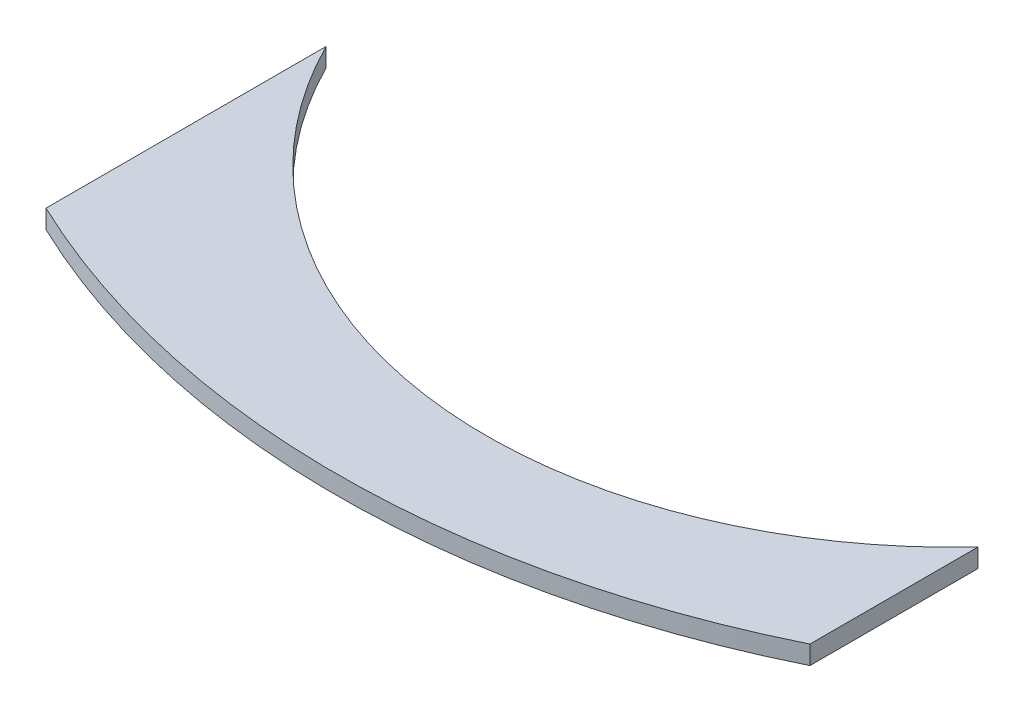
ISO-10303-21;
HEADER;
FILE_DESCRIPTION(('STEP AP214'),'2;1');
FILE_NAME('part.step','',(''),(''),'','','');
FILE_SCHEMA(('AUTOMOTIVE_DESIGN { 1 0 10303 214 1 1 1 1 }'));
ENDSEC;
DATA;
#1=APPLICATION_CONTEXT('core data for automotive mechanical design processes');
#2=APPLICATION_PROTOCOL_DEFINITION('international standard','automotive_design',2000,#1);
#3=PRODUCT_CONTEXT('',#1,'mechanical');
#4=PRODUCT('Part','Part','',(#3));
#5=PRODUCT_RELATED_PRODUCT_CATEGORY('part','',(#4));
#6=PRODUCT_DEFINITION_FORMATION('','',#4);
#7=PRODUCT_DEFINITION_CONTEXT('part definition',#1,'design');
#8=PRODUCT_DEFINITION('design','',#6,#7);
#9=PRODUCT_DEFINITION_SHAPE('','',#8);
#10=(LENGTH_UNIT() NAMED_UNIT(*) SI_UNIT(.MILLI.,.METRE.));
#11=(NAMED_UNIT(*) PLANE_ANGLE_UNIT() SI_UNIT($,.RADIAN.));
#12=(NAMED_UNIT(*) SI_UNIT($,.STERADIAN.) SOLID_ANGLE_UNIT());
#13=UNCERTAINTY_MEASURE_WITH_UNIT(LENGTH_MEASURE(1.E-05),#10,'distance_accuracy_value','');
#14=(GEOMETRIC_REPRESENTATION_CONTEXT(3) GLOBAL_UNCERTAINTY_ASSIGNED_CONTEXT((#13)) GLOBAL_UNIT_ASSIGNED_CONTEXT((#10,
#11,#12)) REPRESENTATION_CONTEXT('',''));
#15=CARTESIAN_POINT('',(0.,0.,0.));
#16=DIRECTION('',(0.,0.,1.));
#17=DIRECTION('',(1.,0.,0.));
#18=AXIS2_PLACEMENT_3D('',#15,#16,#17);
#19=CARTESIAN_POINT('',(67.,-3.,-56.2045990927054));
#20=DIRECTION('',(0.,1.,0.));
#21=DIRECTION('',(0.,0.,1.));
#22=AXIS2_PLACEMENT_3D('',#19,#20,#21);
#23=CYLINDRICAL_SURFACE('',#22,75.);
#24=CARTESIAN_POINT('',(67.,0.,-56.2045990927054));
#25=DIRECTION('',(0.,-1.,0.));
#26=DIRECTION('',(0.,0.,1.));
#27=AXIS2_PLACEMENT_3D('',#24,#25,#26);
#28=CIRCLE('',#27,75.);
#29=CARTESIAN_POINT('',(122.,0.,-5.21440395677758));
#30=VERTEX_POINT('',#29);
#31=CARTESIAN_POINT('',(0.,0.,-22.5));
#32=VERTEX_POINT('',#31);
#33=EDGE_CURVE('E113',#30,#32,#28,.T.);
#34=ORIENTED_EDGE('',*,*,#33,.F.);
#35=DIRECTION('',(0.,1.,0.));
#36=VECTOR('',#35,1.);
#37=CARTESIAN_POINT('',(122.,-3.,-5.21440395677758));
#38=LINE('',#37,#36);
#39=CARTESIAN_POINT('',(122.,-3.,-5.21440395677758));
#40=VERTEX_POINT('',#39);
#41=EDGE_CURVE('E11',#40,#30,#38,.T.);
#42=ORIENTED_EDGE('',*,*,#41,.F.);
#43=CARTESIAN_POINT('',(67.,-3.,-56.2045990927054));
#44=DIRECTION('',(0.,-1.,0.));
#45=DIRECTION('',(0.,0.,1.));
#46=AXIS2_PLACEMENT_3D('',#43,#44,#45);
#47=CIRCLE('',#46,75.);
#48=CARTESIAN_POINT('',(0.,-3.,-22.5));
#49=VERTEX_POINT('',#48);
#50=EDGE_CURVE('E104',#40,#49,#47,.T.);
#51=ORIENTED_EDGE('',*,*,#50,.T.);
#52=DIRECTION('',(0.,1.,0.));
#53=VECTOR('',#52,1.);
#54=CARTESIAN_POINT('',(0.,-3.,-22.5));
#55=LINE('',#54,#53);
#56=EDGE_CURVE('E45',#49,#32,#55,.T.);
#57=ORIENTED_EDGE('',*,*,#56,.T.);
#58=EDGE_LOOP('',(#34,#42,#51,#57));
#59=FACE_BOUND('',#58,.T.);
#60=ADVANCED_FACE('F42',(#59),#23,.F.);
#61=CARTESIAN_POINT('',(122.,-3.,-5.21440395677758));
#62=DIRECTION('',(1.,0.,0.));
#63=DIRECTION('',(0.,0.,-1.));
#64=AXIS2_PLACEMENT_3D('',#61,#62,#63);
#65=PLANE('',#64);
#66=DIRECTION('',(0.,0.,-1.));
#67=VECTOR('',#66,1.);
#68=CARTESIAN_POINT('',(122.,0.,-5.21440395677758));
#69=LINE('',#68,#67);
#70=CARTESIAN_POINT('',(122.,0.,21.7855960432224));
#71=VERTEX_POINT('',#70);
#72=EDGE_CURVE('E108',#71,#30,#69,.T.);
#73=ORIENTED_EDGE('',*,*,#72,.F.);
#74=DIRECTION('',(0.,1.,0.));
#75=VECTOR('',#74,1.);
#76=CARTESIAN_POINT('',(122.,-3.,21.7855960432224));
#77=LINE('',#76,#75);
#78=CARTESIAN_POINT('',(122.,-3.,21.7855960432224));
#79=VERTEX_POINT('',#78);
#80=EDGE_CURVE('E52',#79,#71,#77,.T.);
#81=ORIENTED_EDGE('',*,*,#80,.F.);
#82=DIRECTION('',(0.,0.,-1.));
#83=VECTOR('',#82,1.);
#84=CARTESIAN_POINT('',(122.,-3.,-5.21440395677758));
#85=LINE('',#84,#83);
#86=EDGE_CURVE('E99',#79,#40,#85,.T.);
#87=ORIENTED_EDGE('',*,*,#86,.T.);
#88=ORIENTED_EDGE('',*,*,#41,.T.);
#89=EDGE_LOOP('',(#73,#81,#87,#88));
#90=FACE_BOUND('',#89,.T.);
#91=ADVANCED_FACE('F128',(#90),#65,.T.);
#92=CARTESIAN_POINT('',(60.2621188699294,-3.,-103.86643948971));
#93=DIRECTION('',(0.,1.,0.));
#94=DIRECTION('',(0.,0.,1.));
#95=AXIS2_PLACEMENT_3D('',#92,#93,#94);
#96=CYLINDRICAL_SURFACE('',#95,140.);
#97=CARTESIAN_POINT('',(60.2621188699294,0.,-103.86643948971));
#98=DIRECTION('',(0.,1.,0.));
#99=DIRECTION('',(0.,0.,1.));
#100=AXIS2_PLACEMENT_3D('',#97,#98,#99);
#101=CIRCLE('',#100,140.);
#102=CARTESIAN_POINT('',(0.,0.,22.5));
#103=VERTEX_POINT('',#102);
#104=EDGE_CURVE('E93',#103,#71,#101,.T.);
#105=ORIENTED_EDGE('',*,*,#104,.F.);
#106=DIRECTION('',(0.,1.,0.));
#107=VECTOR('',#106,1.);
#108=CARTESIAN_POINT('',(0.,-3.,22.5));
#109=LINE('',#108,#107);
#110=CARTESIAN_POINT('',(0.,-3.,22.5));
#111=VERTEX_POINT('',#110);
#112=EDGE_CURVE('E88',#111,#103,#109,.T.);
#113=ORIENTED_EDGE('',*,*,#112,.F.);
#114=CARTESIAN_POINT('',(60.2621188699294,-3.,-103.86643948971));
#115=DIRECTION('',(0.,1.,0.));
#116=DIRECTION('',(0.,0.,1.));
#117=AXIS2_PLACEMENT_3D('',#114,#115,#116);
#118=CIRCLE('',#117,140.);
#119=EDGE_CURVE('E91',#111,#79,#118,.T.);
#120=ORIENTED_EDGE('',*,*,#119,.T.);
#121=ORIENTED_EDGE('',*,*,#80,.T.);
#122=EDGE_LOOP('',(#105,#113,#120,#121));
#123=FACE_BOUND('',#122,.T.);
#124=ADVANCED_FACE('F90',(#123),#96,.T.);
#125=CARTESIAN_POINT('',(0.,-3.,-22.5));
#126=DIRECTION('',(-1.,0.,0.));
#127=DIRECTION('',(0.,0.,1.));
#128=AXIS2_PLACEMENT_3D('',#125,#126,#127);
#129=PLANE('',#128);
#130=DIRECTION('',(0.,0.,1.));
#131=VECTOR('',#130,1.);
#132=CARTESIAN_POINT('',(0.,0.,-22.5));
#133=LINE('',#132,#131);
#134=EDGE_CURVE('E117',#32,#103,#133,.T.);
#135=ORIENTED_EDGE('',*,*,#134,.F.);
#136=ORIENTED_EDGE('',*,*,#56,.F.);
#137=DIRECTION('',(0.,0.,1.));
#138=VECTOR('',#137,1.);
#139=CARTESIAN_POINT('',(0.,-3.,-22.5));
#140=LINE('',#139,#138);
#141=EDGE_CURVE('E98',#49,#111,#140,.T.);
#142=ORIENTED_EDGE('',*,*,#141,.T.);
#143=ORIENTED_EDGE('',*,*,#112,.T.);
#144=EDGE_LOOP('',(#135,#136,#142,#143));
#145=FACE_BOUND('',#144,.T.);
#146=ADVANCED_FACE('F102',(#145),#129,.T.);
#147=CARTESIAN_POINT('',(67.,-3.,-56.2045990927054));
#148=DIRECTION('',(0.,1.,0.));
#149=DIRECTION('',(0.,0.,1.));
#150=AXIS2_PLACEMENT_3D('',#147,#148,#149);
#151=PLANE('',#150);
#152=ORIENTED_EDGE('',*,*,#50,.F.);
#153=ORIENTED_EDGE('',*,*,#86,.F.);
#154=ORIENTED_EDGE('',*,*,#119,.F.);
#155=ORIENTED_EDGE('',*,*,#141,.F.);
#156=EDGE_LOOP('',(#152,#153,#154,#155));
#157=FACE_BOUND('',#156,.T.);
#158=ADVANCED_FACE('F97',(#157),#151,.F.);
#159=CARTESIAN_POINT('',(67.,0.,-56.2045990927054));
#160=DIRECTION('',(0.,1.,0.));
#161=DIRECTION('',(0.,0.,1.));
#162=AXIS2_PLACEMENT_3D('',#159,#160,#161);
#163=PLANE('',#162);
#164=ORIENTED_EDGE('',*,*,#33,.T.);
#165=ORIENTED_EDGE('',*,*,#134,.T.);
#166=ORIENTED_EDGE('',*,*,#104,.T.);
#167=ORIENTED_EDGE('',*,*,#72,.T.);
#168=EDGE_LOOP('',(#164,#165,#166,#167));
#169=FACE_BOUND('',#168,.T.);
#170=ADVANCED_FACE('F127',(#169),#163,.T.);
#171=CLOSED_SHELL('',(#60,#91,#124,#146,#158,#170));
#172=MANIFOLD_SOLID_BREP('B2',#171);
#173=ADVANCED_BREP_SHAPE_REPRESENTATION('',(#18,#172),#14);
#174=SHAPE_DEFINITION_REPRESENTATION(#9,#173);
ENDSEC;
END-ISO-10303-21;
